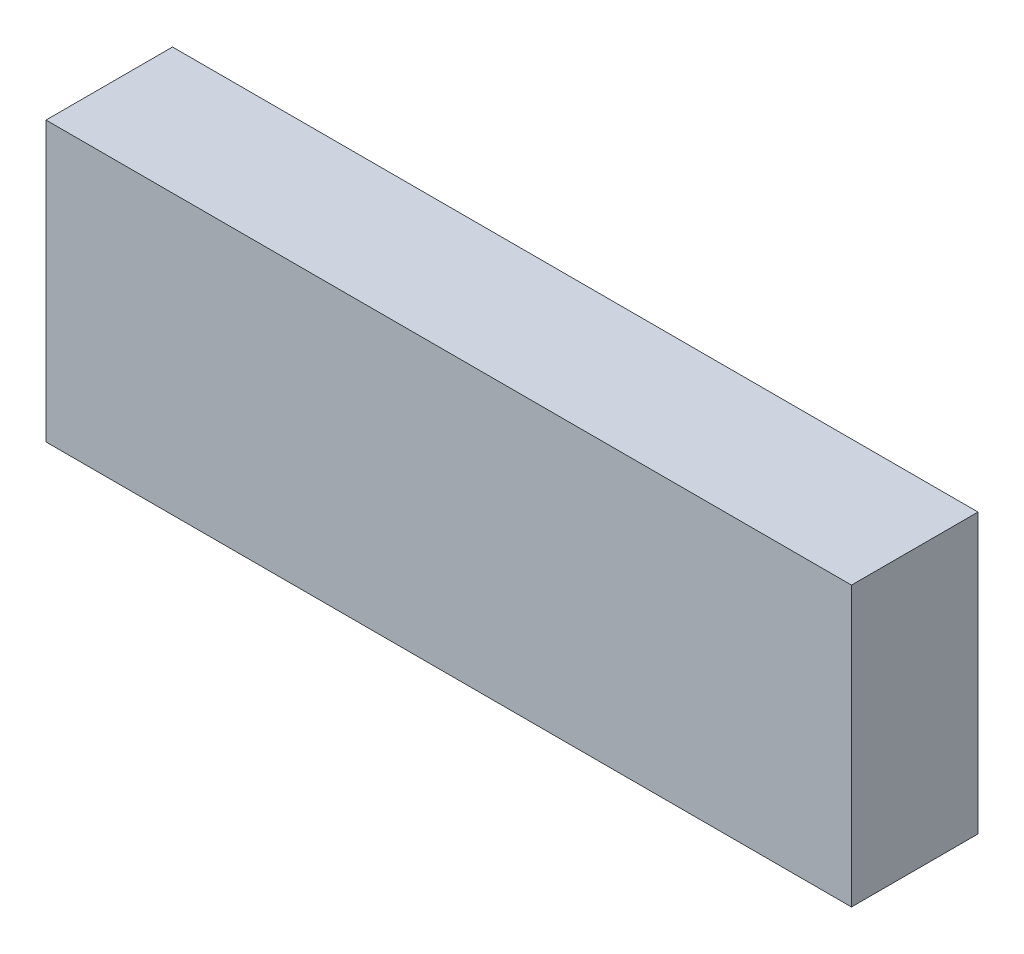
ISO-10303-21;
HEADER;
FILE_DESCRIPTION(('STEP AP214'),'2;1');
FILE_NAME('part.step','',(''),(''),'','','');
FILE_SCHEMA(('AUTOMOTIVE_DESIGN { 1 0 10303 214 1 1 1 1 }'));
ENDSEC;
DATA;
#1=APPLICATION_CONTEXT('core data for automotive mechanical design processes');
#2=APPLICATION_PROTOCOL_DEFINITION('international standard','automotive_design',2000,#1);
#3=PRODUCT_CONTEXT('',#1,'mechanical');
#4=PRODUCT('Part','Part','',(#3));
#5=PRODUCT_RELATED_PRODUCT_CATEGORY('part','',(#4));
#6=PRODUCT_DEFINITION_FORMATION('','',#4);
#7=PRODUCT_DEFINITION_CONTEXT('part definition',#1,'design');
#8=PRODUCT_DEFINITION('design','',#6,#7);
#9=PRODUCT_DEFINITION_SHAPE('','',#8);
#10=(LENGTH_UNIT() NAMED_UNIT(*) SI_UNIT(.MILLI.,.METRE.));
#11=(NAMED_UNIT(*) PLANE_ANGLE_UNIT() SI_UNIT($,.RADIAN.));
#12=(NAMED_UNIT(*) SI_UNIT($,.STERADIAN.) SOLID_ANGLE_UNIT());
#13=UNCERTAINTY_MEASURE_WITH_UNIT(LENGTH_MEASURE(1.E-05),#10,'distance_accuracy_value','');
#14=(GEOMETRIC_REPRESENTATION_CONTEXT(3) GLOBAL_UNCERTAINTY_ASSIGNED_CONTEXT((#13)) GLOBAL_UNIT_ASSIGNED_CONTEXT((#10,
#11,#12)) REPRESENTATION_CONTEXT('',''));
#15=CARTESIAN_POINT('',(0.,0.,0.));
#16=DIRECTION('',(0.,0.,1.));
#17=DIRECTION('',(1.,0.,0.));
#18=AXIS2_PLACEMENT_3D('',#15,#16,#17);
#19=CARTESIAN_POINT('',(173.375002412066,125.81394047579,-39.));
#20=DIRECTION('',(0.,0.,-1.));
#21=DIRECTION('',(-1.,0.,0.));
#22=AXIS2_PLACEMENT_3D('',#19,#20,#21);
#23=PLANE('',#22);
#24=DIRECTION('',(0.,1.,0.));
#25=VECTOR('',#24,1.);
#26=CARTESIAN_POINT('',(173.693316182103,125.81394047579,-39.));
#27=LINE('',#26,#25);
#28=CARTESIAN_POINT('',(173.693316182103,126.034295160808,-39.));
#29=VERTEX_POINT('',#28);
#30=CARTESIAN_POINT('',(173.693316182103,125.81394047579,-39.));
#31=VERTEX_POINT('',#30);
#32=EDGE_CURVE('E79',#29,#31,#27,.F.);
#33=ORIENTED_EDGE('',*,*,#32,.F.);
#34=DIRECTION('',(1.,0.,0.));
#35=VECTOR('',#34,1.);
#36=CARTESIAN_POINT('',(173.693316182103,126.034295160808,-39.));
#37=LINE('',#36,#35);
#38=CARTESIAN_POINT('',(173.056688642029,126.034295160808,-39.));
#39=VERTEX_POINT('',#38);
#40=EDGE_CURVE('E55',#39,#29,#37,.T.);
#41=ORIENTED_EDGE('',*,*,#40,.F.);
#42=DIRECTION('',(0.,1.,0.));
#43=VECTOR('',#42,1.);
#44=CARTESIAN_POINT('',(173.056688642029,126.034295160808,-39.));
#45=LINE('',#44,#43);
#46=CARTESIAN_POINT('',(173.056688642029,125.81394047579,-39.));
#47=VERTEX_POINT('',#46);
#48=EDGE_CURVE('E57',#47,#39,#45,.T.);
#49=ORIENTED_EDGE('',*,*,#48,.F.);
#50=DIRECTION('',(1.,0.,0.));
#51=VECTOR('',#50,1.);
#52=CARTESIAN_POINT('',(173.056688642029,125.81394047579,-39.));
#53=LINE('',#52,#51);
#54=EDGE_CURVE('E20',#31,#47,#53,.F.);
#55=ORIENTED_EDGE('',*,*,#54,.F.);
#56=EDGE_LOOP('',(#33,#41,#49,#55));
#57=FACE_BOUND('',#56,.T.);
#58=ADVANCED_FACE('F17',(#57),#23,.F.);
#59=CARTESIAN_POINT('',(173.056688642029,125.81394047579,-39.1));
#60=DIRECTION('',(0.,-1.,0.));
#61=DIRECTION('',(0.,0.,-1.));
#62=AXIS2_PLACEMENT_3D('',#59,#60,#61);
#63=PLANE('',#62);
#64=DIRECTION('',(-1.,0.,0.));
#65=VECTOR('',#64,1.);
#66=CARTESIAN_POINT('',(173.375002412066,125.81394047579,-39.1));
#67=LINE('',#66,#65);
#68=CARTESIAN_POINT('',(173.693316182103,125.81394047579,-39.1));
#69=VERTEX_POINT('',#68);
#70=CARTESIAN_POINT('',(173.056688642029,125.81394047579,-39.1));
#71=VERTEX_POINT('',#70);
#72=EDGE_CURVE('E83',#69,#71,#67,.T.);
#73=ORIENTED_EDGE('',*,*,#72,.F.);
#74=DIRECTION('',(0.,0.,-1.));
#75=VECTOR('',#74,1.);
#76=CARTESIAN_POINT('',(173.693316182103,125.81394047579,-39.1));
#77=LINE('',#76,#75);
#78=EDGE_CURVE('E68',#31,#69,#77,.T.);
#79=ORIENTED_EDGE('',*,*,#78,.F.);
#80=ORIENTED_EDGE('',*,*,#54,.T.);
#81=DIRECTION('',(0.,0.,1.));
#82=VECTOR('',#81,1.);
#83=CARTESIAN_POINT('',(173.056688642029,125.81394047579,-39.1));
#84=LINE('',#83,#82);
#85=EDGE_CURVE('E63',#71,#47,#84,.T.);
#86=ORIENTED_EDGE('',*,*,#85,.F.);
#87=EDGE_LOOP('',(#73,#79,#80,#86));
#88=FACE_BOUND('',#87,.T.);
#89=ADVANCED_FACE('F65',(#88),#63,.T.);
#90=CARTESIAN_POINT('',(173.056688642029,126.034295160808,-39.1));
#91=DIRECTION('',(-1.,0.,0.));
#92=DIRECTION('',(0.,0.,1.));
#93=AXIS2_PLACEMENT_3D('',#90,#91,#92);
#94=PLANE('',#93);
#95=DIRECTION('',(0.,1.,0.));
#96=VECTOR('',#95,1.);
#97=CARTESIAN_POINT('',(173.056688642029,125.81394047579,-39.1));
#98=LINE('',#97,#96);
#99=CARTESIAN_POINT('',(173.056688642029,126.034295160808,-39.1));
#100=VERTEX_POINT('',#99);
#101=EDGE_CURVE('E72',#71,#100,#98,.T.);
#102=ORIENTED_EDGE('',*,*,#101,.F.);
#103=ORIENTED_EDGE('',*,*,#85,.T.);
#104=ORIENTED_EDGE('',*,*,#48,.T.);
#105=DIRECTION('',(0.,0.,1.));
#106=VECTOR('',#105,1.);
#107=CARTESIAN_POINT('',(173.056688642029,126.034295160808,-39.1));
#108=LINE('',#107,#106);
#109=EDGE_CURVE('E75',#100,#39,#108,.T.);
#110=ORIENTED_EDGE('',*,*,#109,.F.);
#111=EDGE_LOOP('',(#102,#103,#104,#110));
#112=FACE_BOUND('',#111,.T.);
#113=ADVANCED_FACE('F70',(#112),#94,.T.);
#114=CARTESIAN_POINT('',(173.693316182103,126.034295160808,-39.1));
#115=DIRECTION('',(0.,1.,0.));
#116=DIRECTION('',(0.,0.,1.));
#117=AXIS2_PLACEMENT_3D('',#114,#115,#116);
#118=PLANE('',#117);
#119=DIRECTION('',(-1.,0.,0.));
#120=VECTOR('',#119,1.);
#121=CARTESIAN_POINT('',(173.375002412066,126.034295160808,-39.1));
#122=LINE('',#121,#120);
#123=CARTESIAN_POINT('',(173.693316182103,126.034295160808,-39.1));
#124=VERTEX_POINT('',#123);
#125=EDGE_CURVE('E26',#100,#124,#122,.F.);
#126=ORIENTED_EDGE('',*,*,#125,.F.);
#127=ORIENTED_EDGE('',*,*,#109,.T.);
#128=ORIENTED_EDGE('',*,*,#40,.T.);
#129=DIRECTION('',(0.,0.,-1.));
#130=VECTOR('',#129,1.);
#131=CARTESIAN_POINT('',(173.693316182103,126.034295160808,-39.1));
#132=LINE('',#131,#130);
#133=EDGE_CURVE('E35',#124,#29,#132,.F.);
#134=ORIENTED_EDGE('',*,*,#133,.F.);
#135=EDGE_LOOP('',(#126,#127,#128,#134));
#136=FACE_BOUND('',#135,.T.);
#137=ADVANCED_FACE('F89',(#136),#118,.T.);
#138=CARTESIAN_POINT('',(173.693316182103,125.81394047579,-39.1));
#139=DIRECTION('',(1.,0.,0.));
#140=DIRECTION('',(0.,0.,-1.));
#141=AXIS2_PLACEMENT_3D('',#138,#139,#140);
#142=PLANE('',#141);
#143=DIRECTION('',(0.,1.,0.));
#144=VECTOR('',#143,1.);
#145=CARTESIAN_POINT('',(173.693316182103,125.81394047579,-39.1));
#146=LINE('',#145,#144);
#147=EDGE_CURVE('E11',#124,#69,#146,.F.);
#148=ORIENTED_EDGE('',*,*,#147,.F.);
#149=ORIENTED_EDGE('',*,*,#133,.T.);
#150=ORIENTED_EDGE('',*,*,#32,.T.);
#151=ORIENTED_EDGE('',*,*,#78,.T.);
#152=EDGE_LOOP('',(#148,#149,#150,#151));
#153=FACE_BOUND('',#152,.T.);
#154=ADVANCED_FACE('F91',(#153),#142,.T.);
#155=CARTESIAN_POINT('',(173.375002412066,125.81394047579,-39.1));
#156=DIRECTION('',(0.,0.,-1.));
#157=DIRECTION('',(-1.,0.,0.));
#158=AXIS2_PLACEMENT_3D('',#155,#156,#157);
#159=PLANE('',#158);
#160=ORIENTED_EDGE('',*,*,#125,.T.);
#161=ORIENTED_EDGE('',*,*,#147,.T.);
#162=ORIENTED_EDGE('',*,*,#72,.T.);
#163=ORIENTED_EDGE('',*,*,#101,.T.);
#164=EDGE_LOOP('',(#160,#161,#162,#163));
#165=FACE_BOUND('',#164,.T.);
#166=ADVANCED_FACE('F88',(#165),#159,.T.);
#167=CLOSED_SHELL('',(#58,#89,#113,#137,#154,#166));
#168=MANIFOLD_SOLID_BREP('B1',#167);
#169=ADVANCED_BREP_SHAPE_REPRESENTATION('',(#18,#168),#14);
#170=SHAPE_DEFINITION_REPRESENTATION(#9,#169);
ENDSEC;
END-ISO-10303-21;
